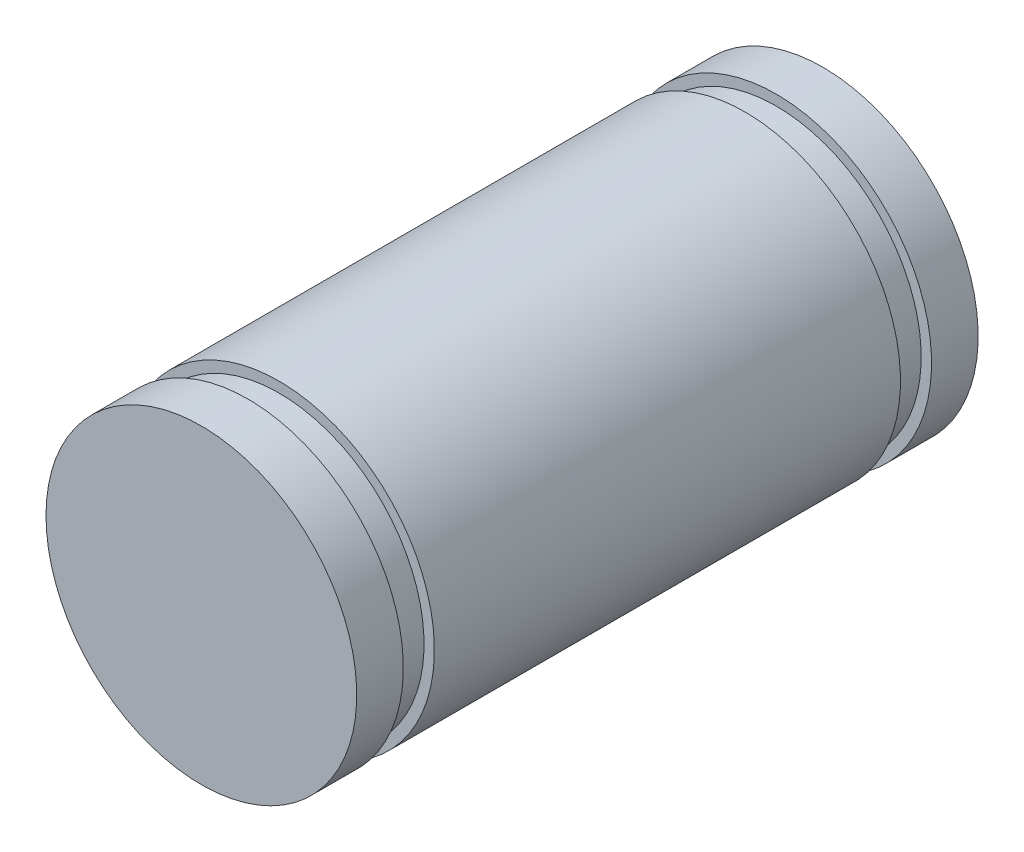
ISO-10303-21;
HEADER;
FILE_DESCRIPTION(('STEP AP214'),'2;1');
FILE_NAME('part.step','',(''),(''),'','','');
FILE_SCHEMA(('AUTOMOTIVE_DESIGN { 1 0 10303 214 1 1 1 1 }'));
ENDSEC;
DATA;
#1=APPLICATION_CONTEXT('core data for automotive mechanical design processes');
#2=APPLICATION_PROTOCOL_DEFINITION('international standard','automotive_design',2000,#1);
#3=PRODUCT_CONTEXT('',#1,'mechanical');
#4=PRODUCT('Part','Part','',(#3));
#5=PRODUCT_RELATED_PRODUCT_CATEGORY('part','',(#4));
#6=PRODUCT_DEFINITION_FORMATION('','',#4);
#7=PRODUCT_DEFINITION_CONTEXT('part definition',#1,'design');
#8=PRODUCT_DEFINITION('design','',#6,#7);
#9=PRODUCT_DEFINITION_SHAPE('','',#8);
#10=(LENGTH_UNIT() NAMED_UNIT(*) SI_UNIT(.MILLI.,.METRE.));
#11=(NAMED_UNIT(*) PLANE_ANGLE_UNIT() SI_UNIT($,.RADIAN.));
#12=(NAMED_UNIT(*) SI_UNIT($,.STERADIAN.) SOLID_ANGLE_UNIT());
#13=UNCERTAINTY_MEASURE_WITH_UNIT(LENGTH_MEASURE(1.E-05),#10,'distance_accuracy_value','');
#14=(GEOMETRIC_REPRESENTATION_CONTEXT(3) GLOBAL_UNCERTAINTY_ASSIGNED_CONTEXT((#13)) GLOBAL_UNIT_ASSIGNED_CONTEXT((#10,
#11,#12)) REPRESENTATION_CONTEXT('',''));
#15=CARTESIAN_POINT('',(0.,0.,0.));
#16=DIRECTION('',(0.,0.,1.));
#17=DIRECTION('',(1.,0.,0.));
#18=AXIS2_PLACEMENT_3D('',#15,#16,#17);
#19=CARTESIAN_POINT('',(0.,0.,12.));
#20=DIRECTION('',(0.,0.,1.));
#21=DIRECTION('',(1.,0.,0.));
#22=AXIS2_PLACEMENT_3D('',#19,#20,#21);
#23=PLANE('',#22);
#24=CARTESIAN_POINT('',(0.,0.,12.));
#25=DIRECTION('',(0.,0.,-1.));
#26=DIRECTION('',(-1.,0.,0.));
#27=AXIS2_PLACEMENT_3D('',#24,#25,#26);
#28=CIRCLE('',#27,3.);
#29=CARTESIAN_POINT('',(-3.,0.,12.));
#30=VERTEX_POINT('',#29);
#31=EDGE_CURVE('E17',#30,#30,#28,.T.);
#32=ORIENTED_EDGE('',*,*,#31,.F.);
#33=EDGE_LOOP('',(#32));
#34=FACE_BOUND('',#33,.T.);
#35=ADVANCED_FACE('F14',(#34),#23,.T.);
#36=CARTESIAN_POINT('',(0.,0.,0.));
#37=DIRECTION('',(0.,0.,1.));
#38=DIRECTION('',(1.,0.,0.));
#39=AXIS2_PLACEMENT_3D('',#36,#37,#38);
#40=PLANE('',#39);
#41=CARTESIAN_POINT('',(0.,0.,0.));
#42=DIRECTION('',(0.,0.,-1.));
#43=DIRECTION('',(-1.,0.,0.));
#44=AXIS2_PLACEMENT_3D('',#41,#42,#43);
#45=CIRCLE('',#44,3.);
#46=CARTESIAN_POINT('',(-3.,0.,0.));
#47=VERTEX_POINT('',#46);
#48=EDGE_CURVE('E52',#47,#47,#45,.F.);
#49=ORIENTED_EDGE('',*,*,#48,.F.);
#50=EDGE_LOOP('',(#49));
#51=FACE_BOUND('',#50,.T.);
#52=ADVANCED_FACE('F66',(#51),#40,.F.);
#53=CARTESIAN_POINT('',(0.,0.,12.));
#54=DIRECTION('',(0.,0.,-1.));
#55=DIRECTION('',(-1.,0.,0.));
#56=AXIS2_PLACEMENT_3D('',#53,#54,#55);
#57=CYLINDRICAL_SURFACE('',#56,3.);
#58=CARTESIAN_POINT('',(0.,0.,11.1));
#59=DIRECTION('',(0.,0.,-1.));
#60=DIRECTION('',(-1.,0.,0.));
#61=AXIS2_PLACEMENT_3D('',#58,#59,#60);
#62=CIRCLE('',#61,3.);
#63=CARTESIAN_POINT('',(-3.,0.,11.1));
#64=VERTEX_POINT('',#63);
#65=EDGE_CURVE('E49',#64,#64,#62,.F.);
#66=ORIENTED_EDGE('',*,*,#65,.T.);
#67=EDGE_LOOP('',(#66));
#68=FACE_BOUND('',#67,.T.);
#69=ORIENTED_EDGE('',*,*,#31,.T.);
#70=EDGE_LOOP('',(#69));
#71=FACE_BOUND('',#70,.T.);
#72=ADVANCED_FACE('F63',(#68,#71),#57,.T.);
#73=CARTESIAN_POINT('',(0.,0.,12.));
#74=DIRECTION('',(0.,0.,-1.));
#75=DIRECTION('',(-1.,0.,0.));
#76=AXIS2_PLACEMENT_3D('',#73,#74,#75);
#77=CYLINDRICAL_SURFACE('',#76,3.);
#78=ORIENTED_EDGE('',*,*,#48,.T.);
#79=EDGE_LOOP('',(#78));
#80=FACE_BOUND('',#79,.T.);
#81=CARTESIAN_POINT('',(0.,0.,0.9));
#82=DIRECTION('',(0.,0.,-1.));
#83=DIRECTION('',(-1.,0.,0.));
#84=AXIS2_PLACEMENT_3D('',#81,#82,#83);
#85=CIRCLE('',#84,3.);
#86=CARTESIAN_POINT('',(-3.,0.,0.9));
#87=VERTEX_POINT('',#86);
#88=EDGE_CURVE('E46',#87,#87,#85,.T.);
#89=ORIENTED_EDGE('',*,*,#88,.T.);
#90=EDGE_LOOP('',(#89));
#91=FACE_BOUND('',#90,.T.);
#92=ADVANCED_FACE('F102',(#80,#91),#77,.T.);
#93=CARTESIAN_POINT('',(-3.,0.,11.1));
#94=DIRECTION('',(0.,0.,1.));
#95=DIRECTION('',(1.,0.,0.));
#96=AXIS2_PLACEMENT_3D('',#93,#94,#95);
#97=PLANE('',#96);
#98=ORIENTED_EDGE('',*,*,#65,.F.);
#99=EDGE_LOOP('',(#98));
#100=FACE_BOUND('',#99,.T.);
#101=CARTESIAN_POINT('',(0.,0.,11.1));
#102=DIRECTION('',(0.,0.,-1.));
#103=DIRECTION('',(-1.,0.,0.));
#104=AXIS2_PLACEMENT_3D('',#101,#102,#103);
#105=CIRCLE('',#104,2.8);
#106=CARTESIAN_POINT('',(-2.8,0.,11.1));
#107=VERTEX_POINT('',#106);
#108=EDGE_CURVE('E42',#107,#107,#105,.T.);
#109=ORIENTED_EDGE('',*,*,#108,.F.);
#110=EDGE_LOOP('',(#109));
#111=FACE_BOUND('',#110,.T.);
#112=ADVANCED_FACE('F98',(#100,#111),#97,.F.);
#113=CARTESIAN_POINT('',(-3.,0.,0.9));
#114=DIRECTION('',(0.,0.,-1.));
#115=DIRECTION('',(-1.,0.,0.));
#116=AXIS2_PLACEMENT_3D('',#113,#114,#115);
#117=PLANE('',#116);
#118=CARTESIAN_POINT('',(0.,0.,0.9));
#119=DIRECTION('',(0.,0.,-1.));
#120=DIRECTION('',(-1.,0.,0.));
#121=AXIS2_PLACEMENT_3D('',#118,#119,#120);
#122=CIRCLE('',#121,2.8);
#123=CARTESIAN_POINT('',(-2.8,0.,0.9));
#124=VERTEX_POINT('',#123);
#125=EDGE_CURVE('E39',#124,#124,#122,.F.);
#126=ORIENTED_EDGE('',*,*,#125,.F.);
#127=EDGE_LOOP('',(#126));
#128=FACE_BOUND('',#127,.T.);
#129=ORIENTED_EDGE('',*,*,#88,.F.);
#130=EDGE_LOOP('',(#129));
#131=FACE_BOUND('',#130,.T.);
#132=ADVANCED_FACE('F94',(#128,#131),#117,.F.);
#133=CARTESIAN_POINT('',(0.,0.,-2.24322429185041));
#134=DIRECTION('',(0.,0.,-1.));
#135=DIRECTION('',(-1.,0.,0.));
#136=AXIS2_PLACEMENT_3D('',#133,#134,#135);
#137=CYLINDRICAL_SURFACE('',#136,2.8);
#138=CARTESIAN_POINT('',(0.,0.,10.5));
#139=DIRECTION('',(0.,0.,-1.));
#140=DIRECTION('',(-1.,0.,0.));
#141=AXIS2_PLACEMENT_3D('',#138,#139,#140);
#142=CIRCLE('',#141,2.8);
#143=CARTESIAN_POINT('',(-2.8,0.,10.5));
#144=VERTEX_POINT('',#143);
#145=EDGE_CURVE('E36',#144,#144,#142,.F.);
#146=ORIENTED_EDGE('',*,*,#145,.T.);
#147=EDGE_LOOP('',(#146));
#148=FACE_BOUND('',#147,.T.);
#149=ORIENTED_EDGE('',*,*,#108,.T.);
#150=EDGE_LOOP('',(#149));
#151=FACE_BOUND('',#150,.T.);
#152=ADVANCED_FACE('F90',(#148,#151),#137,.T.);
#153=CARTESIAN_POINT('',(0.,0.,-2.24322429185041));
#154=DIRECTION('',(0.,0.,-1.));
#155=DIRECTION('',(-1.,0.,0.));
#156=AXIS2_PLACEMENT_3D('',#153,#154,#155);
#157=CYLINDRICAL_SURFACE('',#156,2.8);
#158=ORIENTED_EDGE('',*,*,#125,.T.);
#159=EDGE_LOOP('',(#158));
#160=FACE_BOUND('',#159,.T.);
#161=CARTESIAN_POINT('',(0.,0.,1.5));
#162=DIRECTION('',(0.,0.,-1.));
#163=DIRECTION('',(-1.,0.,0.));
#164=AXIS2_PLACEMENT_3D('',#161,#162,#163);
#165=CIRCLE('',#164,2.8);
#166=CARTESIAN_POINT('',(-2.8,0.,1.5));
#167=VERTEX_POINT('',#166);
#168=EDGE_CURVE('E31',#167,#167,#165,.T.);
#169=ORIENTED_EDGE('',*,*,#168,.T.);
#170=EDGE_LOOP('',(#169));
#171=FACE_BOUND('',#170,.T.);
#172=ADVANCED_FACE('F86',(#160,#171),#157,.T.);
#173=CARTESIAN_POINT('',(-3.,0.,10.5));
#174=DIRECTION('',(0.,0.,-1.));
#175=DIRECTION('',(-1.,0.,0.));
#176=AXIS2_PLACEMENT_3D('',#173,#174,#175);
#177=PLANE('',#176);
#178=ORIENTED_EDGE('',*,*,#145,.F.);
#179=EDGE_LOOP('',(#178));
#180=FACE_BOUND('',#179,.T.);
#181=CARTESIAN_POINT('',(0.,0.,10.5));
#182=DIRECTION('',(0.,0.,-1.));
#183=DIRECTION('',(-1.,0.,0.));
#184=AXIS2_PLACEMENT_3D('',#181,#182,#183);
#185=CIRCLE('',#184,3.);
#186=CARTESIAN_POINT('',(-3.,0.,10.5));
#187=VERTEX_POINT('',#186);
#188=EDGE_CURVE('E22',#187,#187,#185,.T.);
#189=ORIENTED_EDGE('',*,*,#188,.F.);
#190=EDGE_LOOP('',(#189));
#191=FACE_BOUND('',#190,.T.);
#192=ADVANCED_FACE('F79',(#180,#191),#177,.F.);
#193=CARTESIAN_POINT('',(-3.,0.,1.5));
#194=DIRECTION('',(0.,0.,1.));
#195=DIRECTION('',(1.,0.,0.));
#196=AXIS2_PLACEMENT_3D('',#193,#194,#195);
#197=PLANE('',#196);
#198=CARTESIAN_POINT('',(0.,0.,1.5));
#199=DIRECTION('',(0.,0.,-1.));
#200=DIRECTION('',(-1.,0.,0.));
#201=AXIS2_PLACEMENT_3D('',#198,#199,#200);
#202=CIRCLE('',#201,3.);
#203=CARTESIAN_POINT('',(-3.,0.,1.5));
#204=VERTEX_POINT('',#203);
#205=EDGE_CURVE('E10',#204,#204,#202,.F.);
#206=ORIENTED_EDGE('',*,*,#205,.F.);
#207=EDGE_LOOP('',(#206));
#208=FACE_BOUND('',#207,.T.);
#209=ORIENTED_EDGE('',*,*,#168,.F.);
#210=EDGE_LOOP('',(#209));
#211=FACE_BOUND('',#210,.T.);
#212=ADVANCED_FACE('F74',(#208,#211),#197,.F.);
#213=CARTESIAN_POINT('',(0.,0.,12.));
#214=DIRECTION('',(0.,0.,-1.));
#215=DIRECTION('',(-1.,0.,0.));
#216=AXIS2_PLACEMENT_3D('',#213,#214,#215);
#217=CYLINDRICAL_SURFACE('',#216,3.);
#218=ORIENTED_EDGE('',*,*,#205,.T.);
#219=EDGE_LOOP('',(#218));
#220=FACE_BOUND('',#219,.T.);
#221=ORIENTED_EDGE('',*,*,#188,.T.);
#222=EDGE_LOOP('',(#221));
#223=FACE_BOUND('',#222,.T.);
#224=ADVANCED_FACE('F72',(#220,#223),#217,.T.);
#225=CLOSED_SHELL('',(#35,#52,#72,#92,#112,#132,#152,#172,#192,#212,#224));
#226=MANIFOLD_SOLID_BREP('B1',#225);
#227=ADVANCED_BREP_SHAPE_REPRESENTATION('',(#18,#226),#14);
#228=SHAPE_DEFINITION_REPRESENTATION(#9,#227);
ENDSEC;
END-ISO-10303-21;
